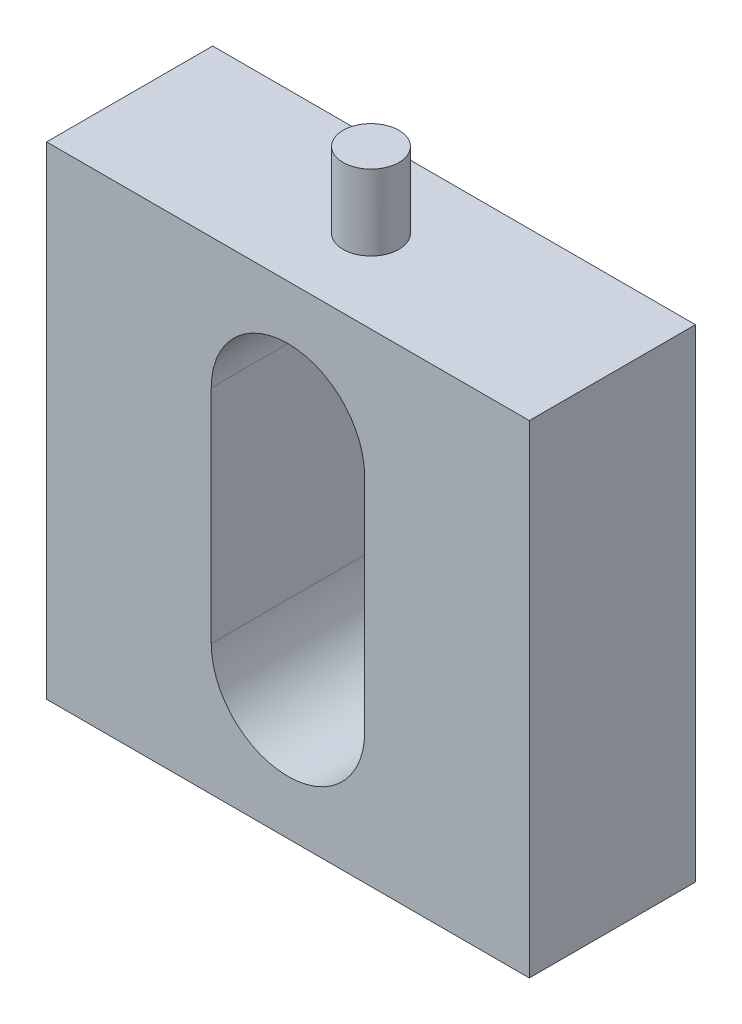
ISO-10303-21;
HEADER;
FILE_DESCRIPTION(('STEP AP214'),'2;1');
FILE_NAME('part.step','',(''),(''),'','','');
FILE_SCHEMA(('AUTOMOTIVE_DESIGN { 1 0 10303 214 1 1 1 1 }'));
ENDSEC;
DATA;
#1=APPLICATION_CONTEXT('core data for automotive mechanical design processes');
#2=APPLICATION_PROTOCOL_DEFINITION('international standard','automotive_design',2000,#1);
#3=PRODUCT_CONTEXT('',#1,'mechanical');
#4=PRODUCT('Part','Part','',(#3));
#5=PRODUCT_RELATED_PRODUCT_CATEGORY('part','',(#4));
#6=PRODUCT_DEFINITION_FORMATION('','',#4);
#7=PRODUCT_DEFINITION_CONTEXT('part definition',#1,'design');
#8=PRODUCT_DEFINITION('design','',#6,#7);
#9=PRODUCT_DEFINITION_SHAPE('','',#8);
#10=(LENGTH_UNIT() NAMED_UNIT(*) SI_UNIT(.MILLI.,.METRE.));
#11=(NAMED_UNIT(*) PLANE_ANGLE_UNIT() SI_UNIT($,.RADIAN.));
#12=(NAMED_UNIT(*) SI_UNIT($,.STERADIAN.) SOLID_ANGLE_UNIT());
#13=UNCERTAINTY_MEASURE_WITH_UNIT(LENGTH_MEASURE(1.E-05),#10,'distance_accuracy_value','');
#14=(GEOMETRIC_REPRESENTATION_CONTEXT(3) GLOBAL_UNCERTAINTY_ASSIGNED_CONTEXT((#13)) GLOBAL_UNIT_ASSIGNED_CONTEXT((#10,
#11,#12)) REPRESENTATION_CONTEXT('',''));
#15=CARTESIAN_POINT('',(0.,0.,0.));
#16=DIRECTION('',(0.,0.,1.));
#17=DIRECTION('',(1.,0.,0.));
#18=AXIS2_PLACEMENT_3D('',#15,#16,#17);
#19=CARTESIAN_POINT('',(0.,0.,4.7625));
#20=DIRECTION('',(1.,0.,0.));
#21=DIRECTION('',(0.,1.,0.));
#22=AXIS2_PLACEMENT_3D('',#19,#20,#21);
#23=PLANE('',#22);
#24=DIRECTION('',(0.,-1.,0.));
#25=VECTOR('',#24,1.);
#26=CARTESIAN_POINT('',(0.,0.,0.));
#27=LINE('',#26,#25);
#28=CARTESIAN_POINT('',(0.,0.,0.));
#29=VERTEX_POINT('',#28);
#30=CARTESIAN_POINT('',(0.,-13.843,0.));
#31=VERTEX_POINT('',#30);
#32=EDGE_CURVE('E154',#29,#31,#27,.T.);
#33=ORIENTED_EDGE('',*,*,#32,.T.);
#34=DIRECTION('',(0.,0.,-1.));
#35=VECTOR('',#34,1.);
#36=CARTESIAN_POINT('',(0.,-13.843,4.7625));
#37=LINE('',#36,#35);
#38=CARTESIAN_POINT('',(0.,-13.843,4.7625));
#39=VERTEX_POINT('',#38);
#40=EDGE_CURVE('E47',#39,#31,#37,.T.);
#41=ORIENTED_EDGE('',*,*,#40,.F.);
#42=DIRECTION('',(0.,-1.,0.));
#43=VECTOR('',#42,1.);
#44=CARTESIAN_POINT('',(0.,0.,4.7625));
#45=LINE('',#44,#43);
#46=CARTESIAN_POINT('',(0.,0.,4.7625));
#47=VERTEX_POINT('',#46);
#48=EDGE_CURVE('E155',#47,#39,#45,.T.);
#49=ORIENTED_EDGE('',*,*,#48,.F.);
#50=DIRECTION('',(0.,0.,-1.));
#51=VECTOR('',#50,1.);
#52=CARTESIAN_POINT('',(0.,0.,4.7625));
#53=LINE('',#52,#51);
#54=EDGE_CURVE('E169',#47,#29,#53,.T.);
#55=ORIENTED_EDGE('',*,*,#54,.T.);
#56=EDGE_LOOP('',(#33,#41,#49,#55));
#57=FACE_BOUND('',#56,.T.);
#58=ADVANCED_FACE('F39',(#57),#23,.F.);
#59=CARTESIAN_POINT('',(0.,-13.843,4.7625));
#60=DIRECTION('',(0.,1.,0.));
#61=DIRECTION('',(0.,0.,1.));
#62=AXIS2_PLACEMENT_3D('',#59,#60,#61);
#63=PLANE('',#62);
#64=DIRECTION('',(1.,0.,0.));
#65=VECTOR('',#64,1.);
#66=CARTESIAN_POINT('',(0.,-13.843,0.));
#67=LINE('',#66,#65);
#68=CARTESIAN_POINT('',(13.843,-13.843,0.));
#69=VERTEX_POINT('',#68);
#70=EDGE_CURVE('E173',#31,#69,#67,.T.);
#71=ORIENTED_EDGE('',*,*,#70,.T.);
#72=DIRECTION('',(0.,0.,-1.));
#73=VECTOR('',#72,1.);
#74=CARTESIAN_POINT('',(13.843,-13.843,4.7625));
#75=LINE('',#74,#73);
#76=CARTESIAN_POINT('',(13.843,-13.843,4.7625));
#77=VERTEX_POINT('',#76);
#78=EDGE_CURVE('E188',#77,#69,#75,.T.);
#79=ORIENTED_EDGE('',*,*,#78,.F.);
#80=DIRECTION('',(1.,0.,0.));
#81=VECTOR('',#80,1.);
#82=CARTESIAN_POINT('',(0.,-13.843,4.7625));
#83=LINE('',#82,#81);
#84=EDGE_CURVE('E159',#39,#77,#83,.T.);
#85=ORIENTED_EDGE('',*,*,#84,.F.);
#86=ORIENTED_EDGE('',*,*,#40,.T.);
#87=EDGE_LOOP('',(#71,#79,#85,#86));
#88=FACE_BOUND('',#87,.T.);
#89=ADVANCED_FACE('F195',(#88),#63,.F.);
#90=CARTESIAN_POINT('',(13.843,0.,4.7625));
#91=DIRECTION('',(-1.,0.,0.));
#92=DIRECTION('',(0.,-1.,0.));
#93=AXIS2_PLACEMENT_3D('',#90,#91,#92);
#94=PLANE('',#93);
#95=DIRECTION('',(0.,1.,0.));
#96=VECTOR('',#95,1.);
#97=CARTESIAN_POINT('',(13.843,0.,0.));
#98=LINE('',#97,#96);
#99=CARTESIAN_POINT('',(13.843,0.,0.));
#100=VERTEX_POINT('',#99);
#101=EDGE_CURVE('E176',#69,#100,#98,.T.);
#102=ORIENTED_EDGE('',*,*,#101,.T.);
#103=DIRECTION('',(0.,0.,-1.));
#104=VECTOR('',#103,1.);
#105=CARTESIAN_POINT('',(13.843,0.,4.7625));
#106=LINE('',#105,#104);
#107=CARTESIAN_POINT('',(13.843,0.,4.7625));
#108=VERTEX_POINT('',#107);
#109=EDGE_CURVE('E184',#108,#100,#106,.T.);
#110=ORIENTED_EDGE('',*,*,#109,.F.);
#111=DIRECTION('',(0.,1.,0.));
#112=VECTOR('',#111,1.);
#113=CARTESIAN_POINT('',(13.843,0.,4.7625));
#114=LINE('',#113,#112);
#115=EDGE_CURVE('E163',#77,#108,#114,.T.);
#116=ORIENTED_EDGE('',*,*,#115,.F.);
#117=ORIENTED_EDGE('',*,*,#78,.T.);
#118=EDGE_LOOP('',(#102,#110,#116,#117));
#119=FACE_BOUND('',#118,.T.);
#120=ADVANCED_FACE('F205',(#119),#94,.F.);
#121=CARTESIAN_POINT('',(0.,0.,4.7625));
#122=DIRECTION('',(0.,-1.,0.));
#123=DIRECTION('',(0.,0.,-1.));
#124=AXIS2_PLACEMENT_3D('',#121,#122,#123);
#125=PLANE('',#124);
#126=CARTESIAN_POINT('',(6.9215,0.,2.38125));
#127=DIRECTION('',(0.,-1.,0.));
#128=DIRECTION('',(0.,0.,-1.));
#129=AXIS2_PLACEMENT_3D('',#126,#127,#128);
#130=CIRCLE('',#129,0.8001);
#131=CARTESIAN_POINT('',(6.9215,0.,1.58115));
#132=VERTEX_POINT('',#131);
#133=EDGE_CURVE('E11',#132,#132,#130,.F.);
#134=ORIENTED_EDGE('',*,*,#133,.F.);
#135=EDGE_LOOP('',(#134));
#136=FACE_BOUND('',#135,.T.);
#137=DIRECTION('',(-1.,0.,0.));
#138=VECTOR('',#137,1.);
#139=CARTESIAN_POINT('',(0.,0.,0.));
#140=LINE('',#139,#138);
#141=EDGE_CURVE('E160',#100,#29,#140,.T.);
#142=ORIENTED_EDGE('',*,*,#141,.T.);
#143=ORIENTED_EDGE('',*,*,#54,.F.);
#144=DIRECTION('',(-1.,0.,0.));
#145=VECTOR('',#144,1.);
#146=CARTESIAN_POINT('',(0.,0.,4.7625));
#147=LINE('',#146,#145);
#148=EDGE_CURVE('E166',#108,#47,#147,.T.);
#149=ORIENTED_EDGE('',*,*,#148,.F.);
#150=ORIENTED_EDGE('',*,*,#109,.T.);
#151=EDGE_LOOP('',(#142,#143,#149,#150));
#152=FACE_BOUND('',#151,.T.);
#153=ADVANCED_FACE('F209',(#136,#152),#125,.F.);
#154=CARTESIAN_POINT('',(0.,0.,4.7625));
#155=DIRECTION('',(0.,0.,1.));
#156=DIRECTION('',(1.,0.,0.));
#157=AXIS2_PLACEMENT_3D('',#154,#155,#156);
#158=PLANE('',#157);
#159=CARTESIAN_POINT('',(6.9215,-3.7465,4.7625));
#160=DIRECTION('',(0.,0.,1.));
#161=DIRECTION('',(1.,0.,0.));
#162=AXIS2_PLACEMENT_3D('',#159,#160,#161);
#163=CIRCLE('',#162,2.2);
#164=CARTESIAN_POINT('',(9.1215,-3.7465,4.7625));
#165=VERTEX_POINT('',#164);
#166=CARTESIAN_POINT('',(4.7215,-3.7465,4.7625));
#167=VERTEX_POINT('',#166);
#168=EDGE_CURVE('E147',#165,#167,#163,.T.);
#169=ORIENTED_EDGE('',*,*,#168,.F.);
#170=DIRECTION('',(0.,1.,0.));
#171=VECTOR('',#170,1.);
#172=CARTESIAN_POINT('',(9.1215,0.,4.7625));
#173=LINE('',#172,#171);
#174=CARTESIAN_POINT('',(9.1215,-10.0965,4.7625));
#175=VERTEX_POINT('',#174);
#176=EDGE_CURVE('E135',#175,#165,#173,.T.);
#177=ORIENTED_EDGE('',*,*,#176,.F.);
#178=CARTESIAN_POINT('',(6.9215,-10.0965,4.7625));
#179=DIRECTION('',(0.,0.,1.));
#180=DIRECTION('',(1.,0.,0.));
#181=AXIS2_PLACEMENT_3D('',#178,#179,#180);
#182=CIRCLE('',#181,2.2);
#183=CARTESIAN_POINT('',(4.7215,-10.0965,4.7625));
#184=VERTEX_POINT('',#183);
#185=EDGE_CURVE('E110',#184,#175,#182,.T.);
#186=ORIENTED_EDGE('',*,*,#185,.F.);
#187=DIRECTION('',(0.,-1.,0.));
#188=VECTOR('',#187,1.);
#189=CARTESIAN_POINT('',(4.7215,0.,4.7625));
#190=LINE('',#189,#188);
#191=EDGE_CURVE('E144',#167,#184,#190,.T.);
#192=ORIENTED_EDGE('',*,*,#191,.F.);
#193=EDGE_LOOP('',(#169,#177,#186,#192));
#194=FACE_BOUND('',#193,.T.);
#195=ORIENTED_EDGE('',*,*,#48,.T.);
#196=ORIENTED_EDGE('',*,*,#84,.T.);
#197=ORIENTED_EDGE('',*,*,#115,.T.);
#198=ORIENTED_EDGE('',*,*,#148,.T.);
#199=EDGE_LOOP('',(#195,#196,#197,#198));
#200=FACE_BOUND('',#199,.T.);
#201=ADVANCED_FACE('F211',(#194,#200),#158,.T.);
#202=CARTESIAN_POINT('',(0.,0.,0.));
#203=DIRECTION('',(0.,0.,1.));
#204=DIRECTION('',(1.,0.,0.));
#205=AXIS2_PLACEMENT_3D('',#202,#203,#204);
#206=PLANE('',#205);
#207=DIRECTION('',(0.,-1.,0.));
#208=VECTOR('',#207,1.);
#209=CARTESIAN_POINT('',(9.1215,-10.0965,0.));
#210=LINE('',#209,#208);
#211=CARTESIAN_POINT('',(9.1215,-3.7465,0.));
#212=VERTEX_POINT('',#211);
#213=CARTESIAN_POINT('',(9.1215,-10.0965,0.));
#214=VERTEX_POINT('',#213);
#215=EDGE_CURVE('E117',#212,#214,#210,.T.);
#216=ORIENTED_EDGE('',*,*,#215,.F.);
#217=CARTESIAN_POINT('',(6.9215,-3.7465,0.));
#218=DIRECTION('',(0.,0.,-1.));
#219=DIRECTION('',(1.,0.,0.));
#220=AXIS2_PLACEMENT_3D('',#217,#218,#219);
#221=CIRCLE('',#220,2.2);
#222=CARTESIAN_POINT('',(4.7215,-3.7465,0.));
#223=VERTEX_POINT('',#222);
#224=EDGE_CURVE('E62',#223,#212,#221,.T.);
#225=ORIENTED_EDGE('',*,*,#224,.F.);
#226=DIRECTION('',(0.,1.,0.));
#227=VECTOR('',#226,1.);
#228=CARTESIAN_POINT('',(4.7215,-10.0965,0.));
#229=LINE('',#228,#227);
#230=CARTESIAN_POINT('',(4.7215,-10.0965,0.));
#231=VERTEX_POINT('',#230);
#232=EDGE_CURVE('E125',#231,#223,#229,.T.);
#233=ORIENTED_EDGE('',*,*,#232,.F.);
#234=CARTESIAN_POINT('',(6.9215,-10.0965,0.));
#235=DIRECTION('',(0.,0.,-1.));
#236=DIRECTION('',(-1.,0.,0.));
#237=AXIS2_PLACEMENT_3D('',#234,#235,#236);
#238=CIRCLE('',#237,2.2);
#239=EDGE_CURVE('E107',#214,#231,#238,.T.);
#240=ORIENTED_EDGE('',*,*,#239,.F.);
#241=EDGE_LOOP('',(#216,#225,#233,#240));
#242=FACE_BOUND('',#241,.T.);
#243=ORIENTED_EDGE('',*,*,#32,.F.);
#244=ORIENTED_EDGE('',*,*,#141,.F.);
#245=ORIENTED_EDGE('',*,*,#101,.F.);
#246=ORIENTED_EDGE('',*,*,#70,.F.);
#247=EDGE_LOOP('',(#243,#244,#245,#246));
#248=FACE_BOUND('',#247,.T.);
#249=ADVANCED_FACE('F122',(#242,#248),#206,.F.);
#250=CARTESIAN_POINT('',(6.9215,2.159,2.38125));
#251=DIRECTION('',(0.,-1.,0.));
#252=DIRECTION('',(0.,0.,-1.));
#253=AXIS2_PLACEMENT_3D('',#250,#251,#252);
#254=CYLINDRICAL_SURFACE('',#253,0.8001);
#255=CARTESIAN_POINT('',(6.9215,2.159,2.38125));
#256=DIRECTION('',(0.,1.,0.));
#257=DIRECTION('',(0.,0.,1.));
#258=AXIS2_PLACEMENT_3D('',#255,#256,#257);
#259=CIRCLE('',#258,0.8001);
#260=CARTESIAN_POINT('',(6.9215,2.159,3.18135));
#261=VERTEX_POINT('',#260);
#262=EDGE_CURVE('E150',#261,#261,#259,.T.);
#263=ORIENTED_EDGE('',*,*,#262,.F.);
#264=EDGE_LOOP('',(#263));
#265=FACE_BOUND('',#264,.T.);
#266=ORIENTED_EDGE('',*,*,#133,.T.);
#267=EDGE_LOOP('',(#266));
#268=FACE_BOUND('',#267,.T.);
#269=ADVANCED_FACE('F219',(#265,#268),#254,.T.);
#270=CARTESIAN_POINT('',(6.9215,2.159,2.38125));
#271=DIRECTION('',(0.,1.,0.));
#272=DIRECTION('',(0.,0.,1.));
#273=AXIS2_PLACEMENT_3D('',#270,#271,#272);
#274=PLANE('',#273);
#275=ORIENTED_EDGE('',*,*,#262,.T.);
#276=EDGE_LOOP('',(#275));
#277=FACE_BOUND('',#276,.T.);
#278=ADVANCED_FACE('F249',(#277),#274,.T.);
#279=CARTESIAN_POINT('',(6.9215,-3.7465,8.001));
#280=DIRECTION('',(0.,0.,-1.));
#281=DIRECTION('',(-1.,0.,0.));
#282=AXIS2_PLACEMENT_3D('',#279,#280,#281);
#283=CYLINDRICAL_SURFACE('',#282,2.2);
#284=ORIENTED_EDGE('',*,*,#168,.T.);
#285=DIRECTION('',(0.,0.,-1.));
#286=VECTOR('',#285,1.);
#287=CARTESIAN_POINT('',(4.7215,-3.7465,8.001));
#288=LINE('',#287,#286);
#289=EDGE_CURVE('E132',#167,#223,#288,.T.);
#290=ORIENTED_EDGE('',*,*,#289,.T.);
#291=ORIENTED_EDGE('',*,*,#224,.T.);
#292=DIRECTION('',(0.,0.,-1.));
#293=VECTOR('',#292,1.);
#294=CARTESIAN_POINT('',(9.1215,-3.7465,8.001));
#295=LINE('',#294,#293);
#296=EDGE_CURVE('E114',#165,#212,#295,.T.);
#297=ORIENTED_EDGE('',*,*,#296,.F.);
#298=EDGE_LOOP('',(#284,#290,#291,#297));
#299=FACE_BOUND('',#298,.T.);
#300=ADVANCED_FACE('F258',(#299),#283,.F.);
#301=CARTESIAN_POINT('',(4.7215,-10.0965,8.001));
#302=DIRECTION('',(-1.,0.,0.));
#303=DIRECTION('',(0.,0.,1.));
#304=AXIS2_PLACEMENT_3D('',#301,#302,#303);
#305=PLANE('',#304);
#306=ORIENTED_EDGE('',*,*,#191,.T.);
#307=DIRECTION('',(0.,0.,-1.));
#308=VECTOR('',#307,1.);
#309=CARTESIAN_POINT('',(4.7215,-10.0965,8.001));
#310=LINE('',#309,#308);
#311=EDGE_CURVE('E113',#184,#231,#310,.T.);
#312=ORIENTED_EDGE('',*,*,#311,.T.);
#313=ORIENTED_EDGE('',*,*,#232,.T.);
#314=ORIENTED_EDGE('',*,*,#289,.F.);
#315=EDGE_LOOP('',(#306,#312,#313,#314));
#316=FACE_BOUND('',#315,.T.);
#317=ADVANCED_FACE('F277',(#316),#305,.F.);
#318=CARTESIAN_POINT('',(6.9215,-10.0965,8.001));
#319=DIRECTION('',(0.,0.,-1.));
#320=DIRECTION('',(-1.,0.,0.));
#321=AXIS2_PLACEMENT_3D('',#318,#319,#320);
#322=CYLINDRICAL_SURFACE('',#321,2.2);
#323=ORIENTED_EDGE('',*,*,#185,.T.);
#324=DIRECTION('',(0.,0.,-1.));
#325=VECTOR('',#324,1.);
#326=CARTESIAN_POINT('',(9.1215,-10.0965,8.001));
#327=LINE('',#326,#325);
#328=EDGE_CURVE('E54',#175,#214,#327,.T.);
#329=ORIENTED_EDGE('',*,*,#328,.T.);
#330=ORIENTED_EDGE('',*,*,#239,.T.);
#331=ORIENTED_EDGE('',*,*,#311,.F.);
#332=EDGE_LOOP('',(#323,#329,#330,#331));
#333=FACE_BOUND('',#332,.T.);
#334=ADVANCED_FACE('F104',(#333),#322,.F.);
#335=CARTESIAN_POINT('',(9.1215,-10.0965,8.001));
#336=DIRECTION('',(1.,0.,0.));
#337=DIRECTION('',(0.,0.,-1.));
#338=AXIS2_PLACEMENT_3D('',#335,#336,#337);
#339=PLANE('',#338);
#340=ORIENTED_EDGE('',*,*,#176,.T.);
#341=ORIENTED_EDGE('',*,*,#296,.T.);
#342=ORIENTED_EDGE('',*,*,#215,.T.);
#343=ORIENTED_EDGE('',*,*,#328,.F.);
#344=EDGE_LOOP('',(#340,#341,#342,#343));
#345=FACE_BOUND('',#344,.T.);
#346=ADVANCED_FACE('F118',(#345),#339,.F.);
#347=CLOSED_SHELL('',(#58,#89,#120,#153,#201,#249,#269,#278,#300,#317,#334,#346));
#348=MANIFOLD_SOLID_BREP('B2',#347);
#349=ADVANCED_BREP_SHAPE_REPRESENTATION('',(#18,#348),#14);
#350=SHAPE_DEFINITION_REPRESENTATION(#9,#349);
ENDSEC;
END-ISO-10303-21;
